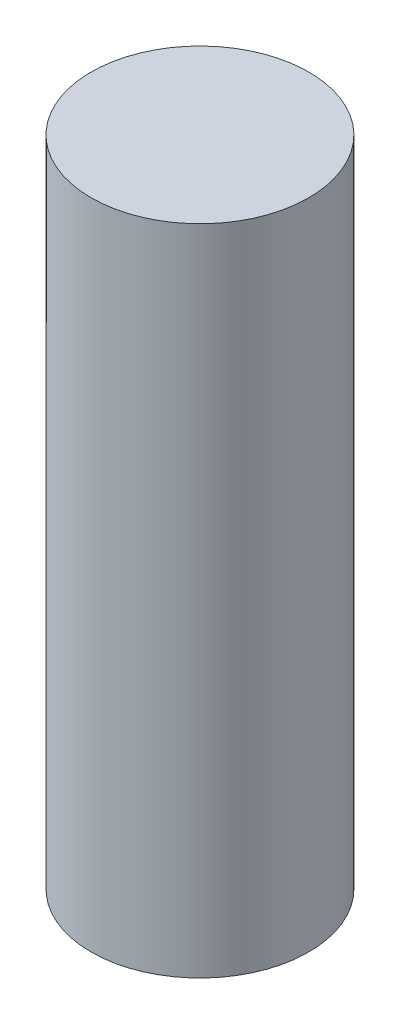
ISO-10303-21;
HEADER;
FILE_DESCRIPTION(('STEP AP214'),'2;1');
FILE_NAME('part.step','',(''),(''),'','','');
FILE_SCHEMA(('AUTOMOTIVE_DESIGN { 1 0 10303 214 1 1 1 1 }'));
ENDSEC;
DATA;
#1=APPLICATION_CONTEXT('core data for automotive mechanical design processes');
#2=APPLICATION_PROTOCOL_DEFINITION('international standard','automotive_design',2000,#1);
#3=PRODUCT_CONTEXT('',#1,'mechanical');
#4=PRODUCT('Part','Part','',(#3));
#5=PRODUCT_RELATED_PRODUCT_CATEGORY('part','',(#4));
#6=PRODUCT_DEFINITION_FORMATION('','',#4);
#7=PRODUCT_DEFINITION_CONTEXT('part definition',#1,'design');
#8=PRODUCT_DEFINITION('design','',#6,#7);
#9=PRODUCT_DEFINITION_SHAPE('','',#8);
#10=(LENGTH_UNIT() NAMED_UNIT(*) SI_UNIT(.MILLI.,.METRE.));
#11=(NAMED_UNIT(*) PLANE_ANGLE_UNIT() SI_UNIT($,.RADIAN.));
#12=(NAMED_UNIT(*) SI_UNIT($,.STERADIAN.) SOLID_ANGLE_UNIT());
#13=UNCERTAINTY_MEASURE_WITH_UNIT(LENGTH_MEASURE(1.E-05),#10,'distance_accuracy_value','');
#14=(GEOMETRIC_REPRESENTATION_CONTEXT(3) GLOBAL_UNCERTAINTY_ASSIGNED_CONTEXT((#13)) GLOBAL_UNIT_ASSIGNED_CONTEXT((#10,
#11,#12)) REPRESENTATION_CONTEXT('',''));
#15=CARTESIAN_POINT('',(0.,0.,0.));
#16=DIRECTION('',(0.,0.,1.));
#17=DIRECTION('',(1.,0.,0.));
#18=AXIS2_PLACEMENT_3D('',#15,#16,#17);
#19=CARTESIAN_POINT('',(0.,7.5,0.));
#20=DIRECTION('',(0.,-1.,0.));
#21=DIRECTION('',(0.,0.,-1.));
#22=AXIS2_PLACEMENT_3D('',#19,#20,#21);
#23=CYLINDRICAL_SURFACE('',#22,1.25);
#24=CARTESIAN_POINT('',(0.,7.5,0.));
#25=DIRECTION('',(0.,1.,0.));
#26=DIRECTION('',(0.,0.,1.));
#27=AXIS2_PLACEMENT_3D('',#24,#25,#26);
#28=CIRCLE('',#27,1.25);
#29=CARTESIAN_POINT('',(0.,7.5,1.25));
#30=VERTEX_POINT('',#29);
#31=EDGE_CURVE('E10',#30,#30,#28,.T.);
#32=ORIENTED_EDGE('',*,*,#31,.F.);
#33=EDGE_LOOP('',(#32));
#34=FACE_BOUND('',#33,.T.);
#35=CARTESIAN_POINT('',(0.,0.,0.));
#36=DIRECTION('',(0.,1.,0.));
#37=DIRECTION('',(0.,0.,1.));
#38=AXIS2_PLACEMENT_3D('',#35,#36,#37);
#39=CIRCLE('',#38,1.25);
#40=CARTESIAN_POINT('',(0.,0.,1.25));
#41=VERTEX_POINT('',#40);
#42=EDGE_CURVE('E44',#41,#41,#39,.T.);
#43=ORIENTED_EDGE('',*,*,#42,.T.);
#44=EDGE_LOOP('',(#43));
#45=FACE_BOUND('',#44,.T.);
#46=ADVANCED_FACE('F41',(#34,#45),#23,.T.);
#47=CARTESIAN_POINT('',(0.,7.5,0.));
#48=DIRECTION('',(0.,1.,0.));
#49=DIRECTION('',(0.,0.,1.));
#50=AXIS2_PLACEMENT_3D('',#47,#48,#49);
#51=PLANE('',#50);
#52=ORIENTED_EDGE('',*,*,#31,.T.);
#53=EDGE_LOOP('',(#52));
#54=FACE_BOUND('',#53,.T.);
#55=ADVANCED_FACE('F58',(#54),#51,.T.);
#56=CARTESIAN_POINT('',(0.,0.,0.));
#57=DIRECTION('',(0.,1.,0.));
#58=DIRECTION('',(0.,0.,1.));
#59=AXIS2_PLACEMENT_3D('',#56,#57,#58);
#60=PLANE('',#59);
#61=ORIENTED_EDGE('',*,*,#42,.F.);
#62=EDGE_LOOP('',(#61));
#63=FACE_BOUND('',#62,.T.);
#64=ADVANCED_FACE('F56',(#63),#60,.F.);
#65=CLOSED_SHELL('',(#46,#55,#64));
#66=MANIFOLD_SOLID_BREP('B2',#65);
#67=ADVANCED_BREP_SHAPE_REPRESENTATION('',(#18,#66),#14);
#68=SHAPE_DEFINITION_REPRESENTATION(#9,#67);
ENDSEC;
END-ISO-10303-21;
